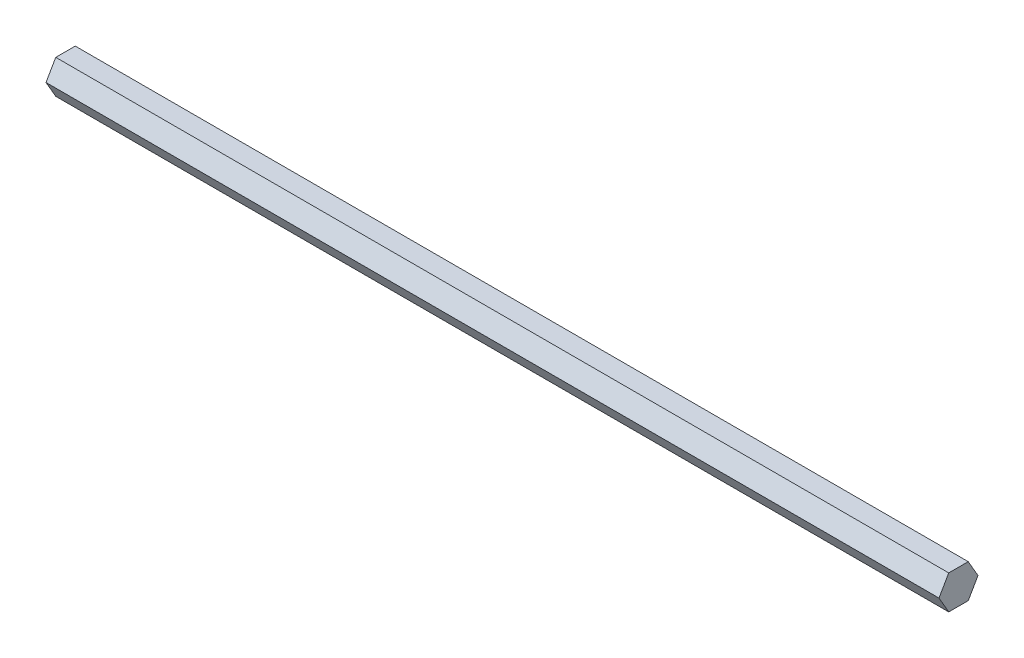
ISO-10303-21;
HEADER;
FILE_DESCRIPTION(('STEP AP214'),'2;1');
FILE_NAME('part.step','',(''),(''),'','','');
FILE_SCHEMA(('AUTOMOTIVE_DESIGN { 1 0 10303 214 1 1 1 1 }'));
ENDSEC;
DATA;
#1=APPLICATION_CONTEXT('core data for automotive mechanical design processes');
#2=APPLICATION_PROTOCOL_DEFINITION('international standard','automotive_design',2000,#1);
#3=PRODUCT_CONTEXT('',#1,'mechanical');
#4=PRODUCT('Part','Part','',(#3));
#5=PRODUCT_RELATED_PRODUCT_CATEGORY('part','',(#4));
#6=PRODUCT_DEFINITION_FORMATION('','',#4);
#7=PRODUCT_DEFINITION_CONTEXT('part definition',#1,'design');
#8=PRODUCT_DEFINITION('design','',#6,#7);
#9=PRODUCT_DEFINITION_SHAPE('','',#8);
#10=(LENGTH_UNIT() NAMED_UNIT(*) SI_UNIT(.MILLI.,.METRE.));
#11=(NAMED_UNIT(*) PLANE_ANGLE_UNIT() SI_UNIT($,.RADIAN.));
#12=(NAMED_UNIT(*) SI_UNIT($,.STERADIAN.) SOLID_ANGLE_UNIT());
#13=UNCERTAINTY_MEASURE_WITH_UNIT(LENGTH_MEASURE(1.E-05),#10,'distance_accuracy_value','');
#14=(GEOMETRIC_REPRESENTATION_CONTEXT(3) GLOBAL_UNCERTAINTY_ASSIGNED_CONTEXT((#13)) GLOBAL_UNIT_ASSIGNED_CONTEXT((#10,
#11,#12)) REPRESENTATION_CONTEXT('',''));
#15=CARTESIAN_POINT('',(0.,0.,0.));
#16=DIRECTION('',(0.,0.,1.));
#17=DIRECTION('',(1.,0.,0.));
#18=AXIS2_PLACEMENT_3D('',#15,#16,#17);
#19=CARTESIAN_POINT('',(370.,-7.00000000000001,-4.04145188432738));
#20=DIRECTION('',(0.,0.499999999999999,0.866025403784439));
#21=DIRECTION('',(0.,-0.866025403784439,0.499999999999999));
#22=AXIS2_PLACEMENT_3D('',#19,#20,#21);
#23=PLANE('',#22);
#24=DIRECTION('',(0.,0.866025403784439,-0.499999999999999));
#25=VECTOR('',#24,1.);
#26=CARTESIAN_POINT('',(0.,-7.00000000000001,-4.04145188432738));
#27=LINE('',#26,#25);
#28=CARTESIAN_POINT('',(0.,-7.00000000000001,-4.04145188432738));
#29=VERTEX_POINT('',#28);
#30=CARTESIAN_POINT('',(0.,0.,-8.08290376865476));
#31=VERTEX_POINT('',#30);
#32=EDGE_CURVE('E119',#29,#31,#27,.T.);
#33=ORIENTED_EDGE('',*,*,#32,.T.);
#34=DIRECTION('',(-1.,0.,0.));
#35=VECTOR('',#34,1.);
#36=CARTESIAN_POINT('',(370.,0.,-8.08290376865476));
#37=LINE('',#36,#35);
#38=CARTESIAN_POINT('',(370.,0.,-8.08290376865476));
#39=VERTEX_POINT('',#38);
#40=EDGE_CURVE('E11',#39,#31,#37,.T.);
#41=ORIENTED_EDGE('',*,*,#40,.F.);
#42=DIRECTION('',(0.,0.866025403784439,-0.499999999999999));
#43=VECTOR('',#42,1.);
#44=CARTESIAN_POINT('',(370.,-7.00000000000001,-4.04145188432738));
#45=LINE('',#44,#43);
#46=CARTESIAN_POINT('',(370.,-7.00000000000001,-4.04145188432738));
#47=VERTEX_POINT('',#46);
#48=EDGE_CURVE('E129',#47,#39,#45,.T.);
#49=ORIENTED_EDGE('',*,*,#48,.F.);
#50=DIRECTION('',(-1.,0.,0.));
#51=VECTOR('',#50,1.);
#52=CARTESIAN_POINT('',(370.,-7.00000000000001,-4.04145188432738));
#53=LINE('',#52,#51);
#54=EDGE_CURVE('E115',#47,#29,#53,.T.);
#55=ORIENTED_EDGE('',*,*,#54,.T.);
#56=EDGE_LOOP('',(#33,#41,#49,#55));
#57=FACE_BOUND('',#56,.T.);
#58=ADVANCED_FACE('F35',(#57),#23,.F.);
#59=CARTESIAN_POINT('',(370.,0.,-8.08290376865476));
#60=DIRECTION('',(0.,-0.500000000000001,0.866025403784438));
#61=DIRECTION('',(0.,-0.866025403784438,-0.500000000000001));
#62=AXIS2_PLACEMENT_3D('',#59,#60,#61);
#63=PLANE('',#62);
#64=DIRECTION('',(0.,0.866025403784438,0.500000000000001));
#65=VECTOR('',#64,1.);
#66=CARTESIAN_POINT('',(0.,0.,-8.08290376865476));
#67=LINE('',#66,#65);
#68=CARTESIAN_POINT('',(0.,7.00000000000002,-4.04145188432737));
#69=VERTEX_POINT('',#68);
#70=EDGE_CURVE('E122',#31,#69,#67,.T.);
#71=ORIENTED_EDGE('',*,*,#70,.T.);
#72=DIRECTION('',(-1.,0.,0.));
#73=VECTOR('',#72,1.);
#74=CARTESIAN_POINT('',(370.,7.00000000000002,-4.04145188432737));
#75=LINE('',#74,#73);
#76=CARTESIAN_POINT('',(370.,7.00000000000002,-4.04145188432737));
#77=VERTEX_POINT('',#76);
#78=EDGE_CURVE('E43',#77,#69,#75,.T.);
#79=ORIENTED_EDGE('',*,*,#78,.F.);
#80=DIRECTION('',(0.,0.866025403784438,0.500000000000001));
#81=VECTOR('',#80,1.);
#82=CARTESIAN_POINT('',(370.,0.,-8.08290376865476));
#83=LINE('',#82,#81);
#84=EDGE_CURVE('E88',#39,#77,#83,.T.);
#85=ORIENTED_EDGE('',*,*,#84,.F.);
#86=ORIENTED_EDGE('',*,*,#40,.T.);
#87=EDGE_LOOP('',(#71,#79,#85,#86));
#88=FACE_BOUND('',#87,.T.);
#89=ADVANCED_FACE('F153',(#88),#63,.F.);
#90=CARTESIAN_POINT('',(370.,7.00000000000002,-4.04145188432737));
#91=DIRECTION('',(0.,-1.,0.));
#92=DIRECTION('',(0.,0.,-1.));
#93=AXIS2_PLACEMENT_3D('',#90,#91,#92);
#94=PLANE('',#93);
#95=DIRECTION('',(0.,0.,1.));
#96=VECTOR('',#95,1.);
#97=CARTESIAN_POINT('',(0.,7.00000000000002,-4.04145188432737));
#98=LINE('',#97,#96);
#99=CARTESIAN_POINT('',(0.,7.00000000000002,4.04145188432738));
#100=VERTEX_POINT('',#99);
#101=EDGE_CURVE('E124',#69,#100,#98,.T.);
#102=ORIENTED_EDGE('',*,*,#101,.T.);
#103=DIRECTION('',(-1.,0.,0.));
#104=VECTOR('',#103,1.);
#105=CARTESIAN_POINT('',(370.,7.00000000000002,4.04145188432738));
#106=LINE('',#105,#104);
#107=CARTESIAN_POINT('',(370.,7.00000000000002,4.04145188432738));
#108=VERTEX_POINT('',#107);
#109=EDGE_CURVE('E110',#108,#100,#106,.T.);
#110=ORIENTED_EDGE('',*,*,#109,.F.);
#111=DIRECTION('',(0.,0.,1.));
#112=VECTOR('',#111,1.);
#113=CARTESIAN_POINT('',(370.,7.00000000000002,-4.04145188432737));
#114=LINE('',#113,#112);
#115=EDGE_CURVE('E101',#77,#108,#114,.T.);
#116=ORIENTED_EDGE('',*,*,#115,.F.);
#117=ORIENTED_EDGE('',*,*,#78,.T.);
#118=EDGE_LOOP('',(#102,#110,#116,#117));
#119=FACE_BOUND('',#118,.T.);
#120=ADVANCED_FACE('F135',(#119),#94,.F.);
#121=CARTESIAN_POINT('',(370.,7.00000000000002,4.04145188432738));
#122=DIRECTION('',(0.,-0.5,-0.866025403784439));
#123=DIRECTION('',(0.,0.866025403784439,-0.5));
#124=AXIS2_PLACEMENT_3D('',#121,#122,#123);
#125=PLANE('',#124);
#126=DIRECTION('',(0.,-0.866025403784439,0.5));
#127=VECTOR('',#126,1.);
#128=CARTESIAN_POINT('',(0.,7.00000000000002,4.04145188432738));
#129=LINE('',#128,#127);
#130=CARTESIAN_POINT('',(0.,0.,8.08290376865477));
#131=VERTEX_POINT('',#130);
#132=EDGE_CURVE('E109',#100,#131,#129,.T.);
#133=ORIENTED_EDGE('',*,*,#132,.T.);
#134=DIRECTION('',(-1.,0.,0.));
#135=VECTOR('',#134,1.);
#136=CARTESIAN_POINT('',(370.,0.,8.08290376865477));
#137=LINE('',#136,#135);
#138=CARTESIAN_POINT('',(370.,0.,8.08290376865477));
#139=VERTEX_POINT('',#138);
#140=EDGE_CURVE('E106',#139,#131,#137,.T.);
#141=ORIENTED_EDGE('',*,*,#140,.F.);
#142=DIRECTION('',(0.,-0.866025403784439,0.5));
#143=VECTOR('',#142,1.);
#144=CARTESIAN_POINT('',(370.,7.00000000000002,4.04145188432738));
#145=LINE('',#144,#143);
#146=EDGE_CURVE('E95',#108,#139,#145,.T.);
#147=ORIENTED_EDGE('',*,*,#146,.F.);
#148=ORIENTED_EDGE('',*,*,#109,.T.);
#149=EDGE_LOOP('',(#133,#141,#147,#148));
#150=FACE_BOUND('',#149,.T.);
#151=ADVANCED_FACE('F107',(#150),#125,.F.);
#152=CARTESIAN_POINT('',(370.,0.,8.08290376865477));
#153=DIRECTION('',(0.,0.5,-0.866025403784439));
#154=DIRECTION('',(0.,0.866025403784439,0.5));
#155=AXIS2_PLACEMENT_3D('',#152,#153,#154);
#156=PLANE('',#155);
#157=DIRECTION('',(0.,-0.866025403784439,-0.5));
#158=VECTOR('',#157,1.);
#159=CARTESIAN_POINT('',(0.,0.,8.08290376865477));
#160=LINE('',#159,#158);
#161=CARTESIAN_POINT('',(0.,-7.00000000000001,4.04145188432739));
#162=VERTEX_POINT('',#161);
#163=EDGE_CURVE('E74',#131,#162,#160,.T.);
#164=ORIENTED_EDGE('',*,*,#163,.T.);
#165=DIRECTION('',(-1.,0.,0.));
#166=VECTOR('',#165,1.);
#167=CARTESIAN_POINT('',(370.,-7.00000000000001,4.04145188432739));
#168=LINE('',#167,#166);
#169=CARTESIAN_POINT('',(370.,-7.00000000000001,4.04145188432739));
#170=VERTEX_POINT('',#169);
#171=EDGE_CURVE('E111',#170,#162,#168,.T.);
#172=ORIENTED_EDGE('',*,*,#171,.F.);
#173=DIRECTION('',(0.,-0.866025403784439,-0.5));
#174=VECTOR('',#173,1.);
#175=CARTESIAN_POINT('',(370.,0.,8.08290376865477));
#176=LINE('',#175,#174);
#177=EDGE_CURVE('E99',#139,#170,#176,.T.);
#178=ORIENTED_EDGE('',*,*,#177,.F.);
#179=ORIENTED_EDGE('',*,*,#140,.T.);
#180=EDGE_LOOP('',(#164,#172,#178,#179));
#181=FACE_BOUND('',#180,.T.);
#182=ADVANCED_FACE('F113',(#181),#156,.F.);
#183=CARTESIAN_POINT('',(370.,-7.00000000000001,4.04145188432739));
#184=DIRECTION('',(0.,1.,0.));
#185=DIRECTION('',(0.,0.,1.));
#186=AXIS2_PLACEMENT_3D('',#183,#184,#185);
#187=PLANE('',#186);
#188=DIRECTION('',(0.,0.,-1.));
#189=VECTOR('',#188,1.);
#190=CARTESIAN_POINT('',(0.,-7.00000000000001,4.04145188432739));
#191=LINE('',#190,#189);
#192=EDGE_CURVE('E80',#162,#29,#191,.T.);
#193=ORIENTED_EDGE('',*,*,#192,.T.);
#194=ORIENTED_EDGE('',*,*,#54,.F.);
#195=DIRECTION('',(0.,0.,-1.));
#196=VECTOR('',#195,1.);
#197=CARTESIAN_POINT('',(370.,-7.00000000000001,4.04145188432739));
#198=LINE('',#197,#196);
#199=EDGE_CURVE('E51',#170,#47,#198,.T.);
#200=ORIENTED_EDGE('',*,*,#199,.F.);
#201=ORIENTED_EDGE('',*,*,#171,.T.);
#202=EDGE_LOOP('',(#193,#194,#200,#201));
#203=FACE_BOUND('',#202,.T.);
#204=ADVANCED_FACE('F142',(#203),#187,.F.);
#205=CARTESIAN_POINT('',(370.,0.,0.));
#206=DIRECTION('',(1.,0.,0.));
#207=DIRECTION('',(0.,0.,-1.));
#208=AXIS2_PLACEMENT_3D('',#205,#206,#207);
#209=PLANE('',#208);
#210=ORIENTED_EDGE('',*,*,#48,.T.);
#211=ORIENTED_EDGE('',*,*,#84,.T.);
#212=ORIENTED_EDGE('',*,*,#115,.T.);
#213=ORIENTED_EDGE('',*,*,#146,.T.);
#214=ORIENTED_EDGE('',*,*,#177,.T.);
#215=ORIENTED_EDGE('',*,*,#199,.T.);
#216=EDGE_LOOP('',(#210,#211,#212,#213,#214,#215));
#217=FACE_BOUND('',#216,.T.);
#218=ADVANCED_FACE('F97',(#217),#209,.T.);
#219=CARTESIAN_POINT('',(0.,0.,0.));
#220=DIRECTION('',(1.,0.,0.));
#221=DIRECTION('',(0.,0.,-1.));
#222=AXIS2_PLACEMENT_3D('',#219,#220,#221);
#223=PLANE('',#222);
#224=ORIENTED_EDGE('',*,*,#32,.F.);
#225=ORIENTED_EDGE('',*,*,#192,.F.);
#226=ORIENTED_EDGE('',*,*,#163,.F.);
#227=ORIENTED_EDGE('',*,*,#132,.F.);
#228=ORIENTED_EDGE('',*,*,#101,.F.);
#229=ORIENTED_EDGE('',*,*,#70,.F.);
#230=EDGE_LOOP('',(#224,#225,#226,#227,#228,#229));
#231=FACE_BOUND('',#230,.T.);
#232=ADVANCED_FACE('F138',(#231),#223,.F.);
#233=CLOSED_SHELL('',(#58,#89,#120,#151,#182,#204,#218,#232));
#234=MANIFOLD_SOLID_BREP('B2',#233);
#235=ADVANCED_BREP_SHAPE_REPRESENTATION('',(#18,#234),#14);
#236=SHAPE_DEFINITION_REPRESENTATION(#9,#235);
ENDSEC;
END-ISO-10303-21;
